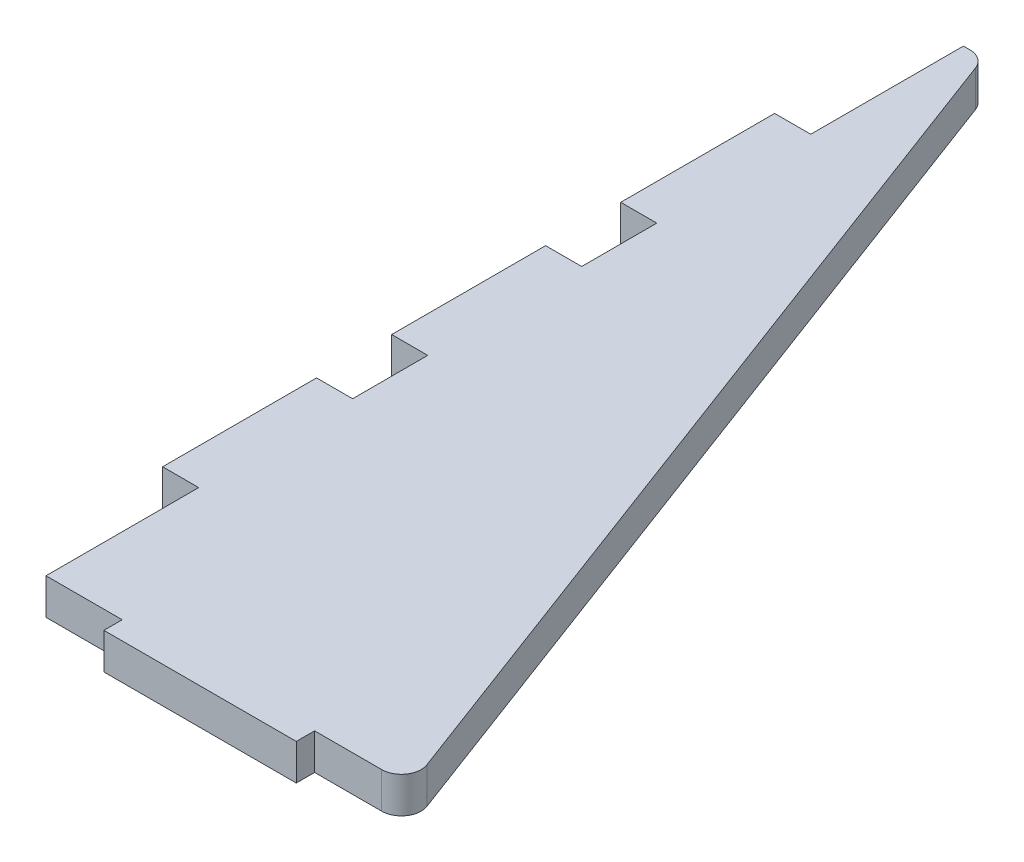
ISO-10303-21;
HEADER;
FILE_DESCRIPTION(('STEP AP214'),'2;1');
FILE_NAME('part.step','',(''),(''),'','','');
FILE_SCHEMA(('AUTOMOTIVE_DESIGN { 1 0 10303 214 1 1 1 1 }'));
ENDSEC;
DATA;
#1=APPLICATION_CONTEXT('core data for automotive mechanical design processes');
#2=APPLICATION_PROTOCOL_DEFINITION('international standard','automotive_design',2000,#1);
#3=PRODUCT_CONTEXT('',#1,'mechanical');
#4=PRODUCT('Part','Part','',(#3));
#5=PRODUCT_RELATED_PRODUCT_CATEGORY('part','',(#4));
#6=PRODUCT_DEFINITION_FORMATION('','',#4);
#7=PRODUCT_DEFINITION_CONTEXT('part definition',#1,'design');
#8=PRODUCT_DEFINITION('design','',#6,#7);
#9=PRODUCT_DEFINITION_SHAPE('','',#8);
#10=(LENGTH_UNIT() NAMED_UNIT(*) SI_UNIT(.MILLI.,.METRE.));
#11=(NAMED_UNIT(*) PLANE_ANGLE_UNIT() SI_UNIT($,.RADIAN.));
#12=(NAMED_UNIT(*) SI_UNIT($,.STERADIAN.) SOLID_ANGLE_UNIT());
#13=UNCERTAINTY_MEASURE_WITH_UNIT(LENGTH_MEASURE(1.E-05),#10,'distance_accuracy_value','');
#14=(GEOMETRIC_REPRESENTATION_CONTEXT(3) GLOBAL_UNCERTAINTY_ASSIGNED_CONTEXT((#13)) GLOBAL_UNIT_ASSIGNED_CONTEXT((#10,
#11,#12)) REPRESENTATION_CONTEXT('',''));
#15=CARTESIAN_POINT('',(0.,0.,0.));
#16=DIRECTION('',(0.,0.,1.));
#17=DIRECTION('',(1.,0.,0.));
#18=AXIS2_PLACEMENT_3D('',#15,#16,#17);
#19=CARTESIAN_POINT('',(41.402,-168.725008290558,76.3016));
#20=DIRECTION('',(0.,0.,1.));
#21=DIRECTION('',(1.,0.,0.));
#22=AXIS2_PLACEMENT_3D('',#19,#20,#21);
#23=PLANE('',#22);
#24=DIRECTION('',(0.,1.,0.));
#25=VECTOR('',#24,1.);
#26=CARTESIAN_POINT('',(41.402,-168.725008290558,76.3016));
#27=LINE('',#26,#25);
#28=CARTESIAN_POINT('',(41.402,0.,76.3016));
#29=VERTEX_POINT('',#28);
#30=CARTESIAN_POINT('',(41.402,6.,76.3016));
#31=VERTEX_POINT('',#30);
#32=EDGE_CURVE('E11',#29,#31,#27,.T.);
#33=ORIENTED_EDGE('',*,*,#32,.F.);
#34=DIRECTION('',(1.,0.,0.));
#35=VECTOR('',#34,1.);
#36=CARTESIAN_POINT('',(41.402,0.,76.3016));
#37=LINE('',#36,#35);
#38=CARTESIAN_POINT('',(52.5684735135771,0.,76.3016));
#39=VERTEX_POINT('',#38);
#40=EDGE_CURVE('E199',#29,#39,#37,.T.);
#41=ORIENTED_EDGE('',*,*,#40,.T.);
#42=DIRECTION('',(0.,1.,0.));
#43=VECTOR('',#42,1.);
#44=CARTESIAN_POINT('',(52.5684735135771,-168.725008290558,76.3016));
#45=LINE('',#44,#43);
#46=CARTESIAN_POINT('',(52.5684735135771,6.,76.3016));
#47=VERTEX_POINT('',#46);
#48=EDGE_CURVE('E195',#39,#47,#45,.T.);
#49=ORIENTED_EDGE('',*,*,#48,.T.);
#50=DIRECTION('',(1.,0.,0.));
#51=VECTOR('',#50,1.);
#52=CARTESIAN_POINT('',(41.402,6.,76.3016));
#53=LINE('',#52,#51);
#54=EDGE_CURVE('E197',#31,#47,#53,.T.);
#55=ORIENTED_EDGE('',*,*,#54,.F.);
#56=EDGE_LOOP('',(#33,#41,#49,#55));
#57=FACE_BOUND('',#56,.T.);
#58=ADVANCED_FACE('F39',(#57),#23,.T.);
#59=CARTESIAN_POINT('',(52.5684735135771,-168.725008290558,73.025));
#60=DIRECTION('',(0.,1.,0.));
#61=DIRECTION('',(0.,0.,1.));
#62=AXIS2_PLACEMENT_3D('',#59,#60,#61);
#63=CYLINDRICAL_SURFACE('',#62,3.27659999999999);
#64=ORIENTED_EDGE('',*,*,#48,.F.);
#65=CARTESIAN_POINT('',(52.5684735135771,0.,73.025));
#66=DIRECTION('',(0.,-1.,0.));
#67=DIRECTION('',(0.,0.,-1.));
#68=AXIS2_PLACEMENT_3D('',#65,#66,#67);
#69=CIRCLE('',#68,3.27659999999999);
#70=CARTESIAN_POINT('',(55.6364496967998,0.,71.8745089312915));
#71=VERTEX_POINT('',#70);
#72=EDGE_CURVE('E131',#39,#71,#69,.F.);
#73=ORIENTED_EDGE('',*,*,#72,.T.);
#74=DIRECTION('',(0.,1.,0.));
#75=VECTOR('',#74,1.);
#76=CARTESIAN_POINT('',(55.6364496967998,-168.725008290558,71.8745089312915));
#77=LINE('',#76,#75);
#78=CARTESIAN_POINT('',(55.6364496967998,6.,71.8745089312915));
#79=VERTEX_POINT('',#78);
#80=EDGE_CURVE('E190',#71,#79,#77,.T.);
#81=ORIENTED_EDGE('',*,*,#80,.T.);
#82=CARTESIAN_POINT('',(52.5684735135771,6.,73.025));
#83=DIRECTION('',(0.,1.,0.));
#84=DIRECTION('',(0.,0.,1.));
#85=AXIS2_PLACEMENT_3D('',#82,#83,#84);
#86=CIRCLE('',#85,3.27659999999999);
#87=EDGE_CURVE('E202',#47,#79,#86,.T.);
#88=ORIENTED_EDGE('',*,*,#87,.F.);
#89=EDGE_LOOP('',(#64,#73,#81,#88));
#90=FACE_BOUND('',#89,.T.);
#91=ADVANCED_FACE('F203',(#90),#63,.T.);
#92=CARTESIAN_POINT('',(55.6364496967998,-168.725008290558,71.8745089312915));
#93=DIRECTION('',(0.936329177569044,0.,-0.351123441588392));
#94=DIRECTION('',(-0.351123441588392,0.,-0.936329177569045));
#95=AXIS2_PLACEMENT_3D('',#92,#93,#94);
#96=PLANE('',#95);
#97=ORIENTED_EDGE('',*,*,#80,.F.);
#98=DIRECTION('',(-0.351123441588392,0.,-0.936329177569045));
#99=VECTOR('',#98,1.);
#100=CARTESIAN_POINT('',(55.6364496967998,0.,71.8745089312915));
#101=LINE('',#100,#99);
#102=CARTESIAN_POINT('',(0.867699696799826,0.,-74.1754910687086));
#103=VERTEX_POINT('',#102);
#104=EDGE_CURVE('E126',#71,#103,#101,.T.);
#105=ORIENTED_EDGE('',*,*,#104,.T.);
#106=DIRECTION('',(0.,1.,0.));
#107=VECTOR('',#106,1.);
#108=CARTESIAN_POINT('',(0.867699696799812,-168.725008290558,-74.1754910687086));
#109=LINE('',#108,#107);
#110=CARTESIAN_POINT('',(0.867699696799812,6.,-74.1754910687086));
#111=VERTEX_POINT('',#110);
#112=EDGE_CURVE('E313',#103,#111,#109,.T.);
#113=ORIENTED_EDGE('',*,*,#112,.T.);
#114=DIRECTION('',(-0.351123441588392,0.,-0.936329177569044));
#115=VECTOR('',#114,1.);
#116=CARTESIAN_POINT('',(55.6364496967998,6.,71.8745089312915));
#117=LINE('',#116,#115);
#118=EDGE_CURVE('E207',#79,#111,#117,.T.);
#119=ORIENTED_EDGE('',*,*,#118,.F.);
#120=EDGE_LOOP('',(#97,#105,#113,#119));
#121=FACE_BOUND('',#120,.T.);
#122=ADVANCED_FACE('F430',(#121),#96,.T.);
#123=CARTESIAN_POINT('',(-2.2002764864229,-168.725008290558,-73.025));
#124=DIRECTION('',(0.,1.,0.));
#125=DIRECTION('',(0.,0.,1.));
#126=AXIS2_PLACEMENT_3D('',#123,#124,#125);
#127=CYLINDRICAL_SURFACE('',#126,3.2766);
#128=ORIENTED_EDGE('',*,*,#112,.F.);
#129=CARTESIAN_POINT('',(-2.2002764864229,0.,-73.025));
#130=DIRECTION('',(0.,-1.,0.));
#131=DIRECTION('',(0.,0.,-1.));
#132=AXIS2_PLACEMENT_3D('',#129,#130,#131);
#133=CIRCLE('',#132,3.2766);
#134=CARTESIAN_POINT('',(-2.2002764864229,0.,-76.3016));
#135=VERTEX_POINT('',#134);
#136=EDGE_CURVE('E309',#103,#135,#133,.F.);
#137=ORIENTED_EDGE('',*,*,#136,.T.);
#138=DIRECTION('',(0.,1.,0.));
#139=VECTOR('',#138,1.);
#140=CARTESIAN_POINT('',(-2.2002764864229,-168.725008290558,-76.3016));
#141=LINE('',#140,#139);
#142=CARTESIAN_POINT('',(-2.2002764864229,6.,-76.3016));
#143=VERTEX_POINT('',#142);
#144=EDGE_CURVE('E308',#135,#143,#141,.T.);
#145=ORIENTED_EDGE('',*,*,#144,.T.);
#146=CARTESIAN_POINT('',(-2.2002764864229,6.,-73.025));
#147=DIRECTION('',(0.,1.,0.));
#148=DIRECTION('',(0.,0.,1.));
#149=AXIS2_PLACEMENT_3D('',#146,#147,#148);
#150=CIRCLE('',#149,3.2766);
#151=EDGE_CURVE('E423',#111,#143,#150,.T.);
#152=ORIENTED_EDGE('',*,*,#151,.F.);
#153=EDGE_LOOP('',(#128,#137,#145,#152));
#154=FACE_BOUND('',#153,.T.);
#155=ADVANCED_FACE('F433',(#154),#127,.T.);
#156=CARTESIAN_POINT('',(-2.2002764864229,-168.725008290558,-76.3016));
#157=DIRECTION('',(0.,0.,-1.));
#158=DIRECTION('',(-1.,0.,0.));
#159=AXIS2_PLACEMENT_3D('',#156,#157,#158);
#160=PLANE('',#159);
#161=ORIENTED_EDGE('',*,*,#144,.F.);
#162=DIRECTION('',(-1.,0.,0.));
#163=VECTOR('',#162,1.);
#164=CARTESIAN_POINT('',(-2.2002764864229,0.,-76.3016));
#165=LINE('',#164,#163);
#166=CARTESIAN_POINT('',(-3.2766,0.,-76.3016));
#167=VERTEX_POINT('',#166);
#168=EDGE_CURVE('E304',#135,#167,#165,.T.);
#169=ORIENTED_EDGE('',*,*,#168,.T.);
#170=DIRECTION('',(0.,1.,0.));
#171=VECTOR('',#170,1.);
#172=CARTESIAN_POINT('',(-3.2766,-168.725008290558,-76.3016));
#173=LINE('',#172,#171);
#174=CARTESIAN_POINT('',(-3.2766,6.,-76.3016));
#175=VERTEX_POINT('',#174);
#176=EDGE_CURVE('E303',#167,#175,#173,.T.);
#177=ORIENTED_EDGE('',*,*,#176,.T.);
#178=DIRECTION('',(-1.,0.,0.));
#179=VECTOR('',#178,1.);
#180=CARTESIAN_POINT('',(-2.2002764864229,6.,-76.3016));
#181=LINE('',#180,#179);
#182=EDGE_CURVE('E419',#143,#175,#181,.T.);
#183=ORIENTED_EDGE('',*,*,#182,.F.);
#184=EDGE_LOOP('',(#161,#169,#177,#183));
#185=FACE_BOUND('',#184,.T.);
#186=ADVANCED_FACE('F437',(#185),#160,.T.);
#187=CARTESIAN_POINT('',(-3.2766,-168.725008290558,-76.3016));
#188=DIRECTION('',(-1.,0.,0.));
#189=DIRECTION('',(0.,0.,1.));
#190=AXIS2_PLACEMENT_3D('',#187,#188,#189);
#191=PLANE('',#190);
#192=ORIENTED_EDGE('',*,*,#176,.F.);
#193=DIRECTION('',(0.,0.,1.));
#194=VECTOR('',#193,1.);
#195=CARTESIAN_POINT('',(-3.2766,0.,-76.3016));
#196=LINE('',#195,#194);
#197=CARTESIAN_POINT('',(-3.2766,0.,-50.9016));
#198=VERTEX_POINT('',#197);
#199=EDGE_CURVE('E299',#167,#198,#196,.T.);
#200=ORIENTED_EDGE('',*,*,#199,.T.);
#201=DIRECTION('',(0.,1.,0.));
#202=VECTOR('',#201,1.);
#203=CARTESIAN_POINT('',(-3.2766,-168.725008290558,-50.9016));
#204=LINE('',#203,#202);
#205=CARTESIAN_POINT('',(-3.2766,6.,-50.9016));
#206=VERTEX_POINT('',#205);
#207=EDGE_CURVE('E298',#198,#206,#204,.T.);
#208=ORIENTED_EDGE('',*,*,#207,.T.);
#209=DIRECTION('',(0.,0.,1.));
#210=VECTOR('',#209,1.);
#211=CARTESIAN_POINT('',(-3.2766,6.,-76.3016));
#212=LINE('',#211,#210);
#213=EDGE_CURVE('E415',#175,#206,#212,.T.);
#214=ORIENTED_EDGE('',*,*,#213,.F.);
#215=EDGE_LOOP('',(#192,#200,#208,#214));
#216=FACE_BOUND('',#215,.T.);
#217=ADVANCED_FACE('F442',(#216),#191,.T.);
#218=CARTESIAN_POINT('',(-3.2766,-168.725008290558,-50.9016));
#219=DIRECTION('',(0.,0.,-1.));
#220=DIRECTION('',(-1.,0.,0.));
#221=AXIS2_PLACEMENT_3D('',#218,#219,#220);
#222=PLANE('',#221);
#223=ORIENTED_EDGE('',*,*,#207,.F.);
#224=DIRECTION('',(-1.,0.,0.));
#225=VECTOR('',#224,1.);
#226=CARTESIAN_POINT('',(-3.2766,0.,-50.9016));
#227=LINE('',#226,#225);
#228=CARTESIAN_POINT('',(-9.2766,0.,-50.9016));
#229=VERTEX_POINT('',#228);
#230=EDGE_CURVE('E294',#198,#229,#227,.T.);
#231=ORIENTED_EDGE('',*,*,#230,.T.);
#232=DIRECTION('',(0.,1.,0.));
#233=VECTOR('',#232,1.);
#234=CARTESIAN_POINT('',(-9.2766,-168.725008290558,-50.9016));
#235=LINE('',#234,#233);
#236=CARTESIAN_POINT('',(-9.2766,6.,-50.9016));
#237=VERTEX_POINT('',#236);
#238=EDGE_CURVE('E293',#229,#237,#235,.T.);
#239=ORIENTED_EDGE('',*,*,#238,.T.);
#240=DIRECTION('',(-1.,0.,0.));
#241=VECTOR('',#240,1.);
#242=CARTESIAN_POINT('',(-3.2766,6.,-50.9016));
#243=LINE('',#242,#241);
#244=EDGE_CURVE('E411',#206,#237,#243,.T.);
#245=ORIENTED_EDGE('',*,*,#244,.F.);
#246=EDGE_LOOP('',(#223,#231,#239,#245));
#247=FACE_BOUND('',#246,.T.);
#248=ADVANCED_FACE('F445',(#247),#222,.T.);
#249=CARTESIAN_POINT('',(-9.2766,-168.725008290558,-50.9016));
#250=DIRECTION('',(-1.,0.,0.));
#251=DIRECTION('',(0.,0.,1.));
#252=AXIS2_PLACEMENT_3D('',#249,#250,#251);
#253=PLANE('',#252);
#254=ORIENTED_EDGE('',*,*,#238,.F.);
#255=DIRECTION('',(0.,0.,1.));
#256=VECTOR('',#255,1.);
#257=CARTESIAN_POINT('',(-9.2766,0.,-50.9016));
#258=LINE('',#257,#256);
#259=CARTESIAN_POINT('',(-9.2766,0.,-25.2984));
#260=VERTEX_POINT('',#259);
#261=EDGE_CURVE('E289',#229,#260,#258,.T.);
#262=ORIENTED_EDGE('',*,*,#261,.T.);
#263=DIRECTION('',(0.,1.,0.));
#264=VECTOR('',#263,1.);
#265=CARTESIAN_POINT('',(-9.2766,-168.725008290558,-25.2984));
#266=LINE('',#265,#264);
#267=CARTESIAN_POINT('',(-9.2766,6.,-25.2984));
#268=VERTEX_POINT('',#267);
#269=EDGE_CURVE('E288',#260,#268,#266,.T.);
#270=ORIENTED_EDGE('',*,*,#269,.T.);
#271=DIRECTION('',(0.,0.,1.));
#272=VECTOR('',#271,1.);
#273=CARTESIAN_POINT('',(-9.2766,6.,-50.9016));
#274=LINE('',#273,#272);
#275=EDGE_CURVE('E407',#237,#268,#274,.T.);
#276=ORIENTED_EDGE('',*,*,#275,.F.);
#277=EDGE_LOOP('',(#254,#262,#270,#276));
#278=FACE_BOUND('',#277,.T.);
#279=ADVANCED_FACE('F449',(#278),#253,.T.);
#280=CARTESIAN_POINT('',(-9.2766,-168.725008290558,-25.2984));
#281=DIRECTION('',(0.,0.,1.));
#282=DIRECTION('',(1.,0.,0.));
#283=AXIS2_PLACEMENT_3D('',#280,#281,#282);
#284=PLANE('',#283);
#285=ORIENTED_EDGE('',*,*,#269,.F.);
#286=DIRECTION('',(1.,0.,0.));
#287=VECTOR('',#286,1.);
#288=CARTESIAN_POINT('',(-9.2766,0.,-25.2984));
#289=LINE('',#288,#287);
#290=CARTESIAN_POINT('',(-3.2766,0.,-25.2984));
#291=VERTEX_POINT('',#290);
#292=EDGE_CURVE('E284',#260,#291,#289,.T.);
#293=ORIENTED_EDGE('',*,*,#292,.T.);
#294=DIRECTION('',(0.,1.,0.));
#295=VECTOR('',#294,1.);
#296=CARTESIAN_POINT('',(-3.2766,-168.725008290558,-25.2984));
#297=LINE('',#296,#295);
#298=CARTESIAN_POINT('',(-3.2766,6.,-25.2984));
#299=VERTEX_POINT('',#298);
#300=EDGE_CURVE('E283',#291,#299,#297,.T.);
#301=ORIENTED_EDGE('',*,*,#300,.T.);
#302=DIRECTION('',(1.,0.,0.));
#303=VECTOR('',#302,1.);
#304=CARTESIAN_POINT('',(-9.2766,6.,-25.2984));
#305=LINE('',#304,#303);
#306=EDGE_CURVE('E403',#268,#299,#305,.T.);
#307=ORIENTED_EDGE('',*,*,#306,.F.);
#308=EDGE_LOOP('',(#285,#293,#301,#307));
#309=FACE_BOUND('',#308,.T.);
#310=ADVANCED_FACE('F454',(#309),#284,.T.);
#311=CARTESIAN_POINT('',(-3.2766,-168.725008290558,-25.2984));
#312=DIRECTION('',(-1.,0.,0.));
#313=DIRECTION('',(0.,0.,1.));
#314=AXIS2_PLACEMENT_3D('',#311,#312,#313);
#315=PLANE('',#314);
#316=ORIENTED_EDGE('',*,*,#300,.F.);
#317=DIRECTION('',(0.,0.,1.));
#318=VECTOR('',#317,1.);
#319=CARTESIAN_POINT('',(-3.2766,0.,-25.2984));
#320=LINE('',#319,#318);
#321=CARTESIAN_POINT('',(-3.2766,0.,-12.8016));
#322=VERTEX_POINT('',#321);
#323=EDGE_CURVE('E279',#291,#322,#320,.T.);
#324=ORIENTED_EDGE('',*,*,#323,.T.);
#325=DIRECTION('',(0.,1.,0.));
#326=VECTOR('',#325,1.);
#327=CARTESIAN_POINT('',(-3.2766,-168.725008290558,-12.8016));
#328=LINE('',#327,#326);
#329=CARTESIAN_POINT('',(-3.2766,6.,-12.8016));
#330=VERTEX_POINT('',#329);
#331=EDGE_CURVE('E278',#322,#330,#328,.T.);
#332=ORIENTED_EDGE('',*,*,#331,.T.);
#333=DIRECTION('',(0.,0.,1.));
#334=VECTOR('',#333,1.);
#335=CARTESIAN_POINT('',(-3.2766,6.,-25.2984));
#336=LINE('',#335,#334);
#337=EDGE_CURVE('E399',#299,#330,#336,.T.);
#338=ORIENTED_EDGE('',*,*,#337,.F.);
#339=EDGE_LOOP('',(#316,#324,#332,#338));
#340=FACE_BOUND('',#339,.T.);
#341=ADVANCED_FACE('F457',(#340),#315,.T.);
#342=CARTESIAN_POINT('',(-3.2766,-168.725008290558,-12.8016));
#343=DIRECTION('',(0.,0.,-1.));
#344=DIRECTION('',(-1.,0.,0.));
#345=AXIS2_PLACEMENT_3D('',#342,#343,#344);
#346=PLANE('',#345);
#347=ORIENTED_EDGE('',*,*,#331,.F.);
#348=DIRECTION('',(-1.,0.,0.));
#349=VECTOR('',#348,1.);
#350=CARTESIAN_POINT('',(-3.2766,0.,-12.8016));
#351=LINE('',#350,#349);
#352=CARTESIAN_POINT('',(-9.2766,0.,-12.8016));
#353=VERTEX_POINT('',#352);
#354=EDGE_CURVE('E274',#322,#353,#351,.T.);
#355=ORIENTED_EDGE('',*,*,#354,.T.);
#356=DIRECTION('',(0.,1.,0.));
#357=VECTOR('',#356,1.);
#358=CARTESIAN_POINT('',(-9.2766,-168.725008290558,-12.8016));
#359=LINE('',#358,#357);
#360=CARTESIAN_POINT('',(-9.2766,6.,-12.8016));
#361=VERTEX_POINT('',#360);
#362=EDGE_CURVE('E273',#353,#361,#359,.T.);
#363=ORIENTED_EDGE('',*,*,#362,.T.);
#364=DIRECTION('',(-1.,0.,0.));
#365=VECTOR('',#364,1.);
#366=CARTESIAN_POINT('',(-3.2766,6.,-12.8016));
#367=LINE('',#366,#365);
#368=EDGE_CURVE('E395',#330,#361,#367,.T.);
#369=ORIENTED_EDGE('',*,*,#368,.F.);
#370=EDGE_LOOP('',(#347,#355,#363,#369));
#371=FACE_BOUND('',#370,.T.);
#372=ADVANCED_FACE('F461',(#371),#346,.T.);
#373=CARTESIAN_POINT('',(-9.2766,-168.725008290558,-12.8016));
#374=DIRECTION('',(-1.,0.,0.));
#375=DIRECTION('',(0.,0.,1.));
#376=AXIS2_PLACEMENT_3D('',#373,#374,#375);
#377=PLANE('',#376);
#378=ORIENTED_EDGE('',*,*,#362,.F.);
#379=DIRECTION('',(0.,0.,1.));
#380=VECTOR('',#379,1.);
#381=CARTESIAN_POINT('',(-9.2766,0.,-12.8016));
#382=LINE('',#381,#380);
#383=CARTESIAN_POINT('',(-9.2766,0.,12.8016));
#384=VERTEX_POINT('',#383);
#385=EDGE_CURVE('E269',#353,#384,#382,.T.);
#386=ORIENTED_EDGE('',*,*,#385,.T.);
#387=DIRECTION('',(0.,1.,0.));
#388=VECTOR('',#387,1.);
#389=CARTESIAN_POINT('',(-9.2766,-168.725008290558,12.8016));
#390=LINE('',#389,#388);
#391=CARTESIAN_POINT('',(-9.2766,6.,12.8016));
#392=VERTEX_POINT('',#391);
#393=EDGE_CURVE('E268',#384,#392,#390,.T.);
#394=ORIENTED_EDGE('',*,*,#393,.T.);
#395=DIRECTION('',(0.,0.,1.));
#396=VECTOR('',#395,1.);
#397=CARTESIAN_POINT('',(-9.2766,6.,-12.8016));
#398=LINE('',#397,#396);
#399=EDGE_CURVE('E391',#361,#392,#398,.T.);
#400=ORIENTED_EDGE('',*,*,#399,.F.);
#401=EDGE_LOOP('',(#378,#386,#394,#400));
#402=FACE_BOUND('',#401,.T.);
#403=ADVANCED_FACE('F466',(#402),#377,.T.);
#404=CARTESIAN_POINT('',(-9.2766,-168.725008290558,12.8016));
#405=DIRECTION('',(0.,0.,1.));
#406=DIRECTION('',(1.,0.,0.));
#407=AXIS2_PLACEMENT_3D('',#404,#405,#406);
#408=PLANE('',#407);
#409=ORIENTED_EDGE('',*,*,#393,.F.);
#410=DIRECTION('',(1.,0.,0.));
#411=VECTOR('',#410,1.);
#412=CARTESIAN_POINT('',(-9.2766,0.,12.8016));
#413=LINE('',#412,#411);
#414=CARTESIAN_POINT('',(-3.2766,0.,12.8016));
#415=VERTEX_POINT('',#414);
#416=EDGE_CURVE('E264',#384,#415,#413,.T.);
#417=ORIENTED_EDGE('',*,*,#416,.T.);
#418=DIRECTION('',(0.,1.,0.));
#419=VECTOR('',#418,1.);
#420=CARTESIAN_POINT('',(-3.2766,-168.725008290558,12.8016));
#421=LINE('',#420,#419);
#422=CARTESIAN_POINT('',(-3.2766,6.,12.8016));
#423=VERTEX_POINT('',#422);
#424=EDGE_CURVE('E263',#415,#423,#421,.T.);
#425=ORIENTED_EDGE('',*,*,#424,.T.);
#426=DIRECTION('',(1.,0.,0.));
#427=VECTOR('',#426,1.);
#428=CARTESIAN_POINT('',(-9.2766,6.,12.8016));
#429=LINE('',#428,#427);
#430=EDGE_CURVE('E387',#392,#423,#429,.T.);
#431=ORIENTED_EDGE('',*,*,#430,.F.);
#432=EDGE_LOOP('',(#409,#417,#425,#431));
#433=FACE_BOUND('',#432,.T.);
#434=ADVANCED_FACE('F469',(#433),#408,.T.);
#435=CARTESIAN_POINT('',(-3.2766,-168.725008290558,12.8016));
#436=DIRECTION('',(-1.,0.,0.));
#437=DIRECTION('',(0.,0.,1.));
#438=AXIS2_PLACEMENT_3D('',#435,#436,#437);
#439=PLANE('',#438);
#440=ORIENTED_EDGE('',*,*,#424,.F.);
#441=DIRECTION('',(0.,0.,1.));
#442=VECTOR('',#441,1.);
#443=CARTESIAN_POINT('',(-3.2766,0.,12.8016));
#444=LINE('',#443,#442);
#445=CARTESIAN_POINT('',(-3.27660000000001,0.,25.2984));
#446=VERTEX_POINT('',#445);
#447=EDGE_CURVE('E259',#415,#446,#444,.T.);
#448=ORIENTED_EDGE('',*,*,#447,.T.);
#449=DIRECTION('',(0.,1.,0.));
#450=VECTOR('',#449,1.);
#451=CARTESIAN_POINT('',(-3.27660000000001,-168.725008290558,25.2984));
#452=LINE('',#451,#450);
#453=CARTESIAN_POINT('',(-3.27660000000001,6.,25.2984));
#454=VERTEX_POINT('',#453);
#455=EDGE_CURVE('E258',#446,#454,#452,.T.);
#456=ORIENTED_EDGE('',*,*,#455,.T.);
#457=DIRECTION('',(0.,0.,1.));
#458=VECTOR('',#457,1.);
#459=CARTESIAN_POINT('',(-3.2766,6.,12.8016));
#460=LINE('',#459,#458);
#461=EDGE_CURVE('E383',#423,#454,#460,.T.);
#462=ORIENTED_EDGE('',*,*,#461,.F.);
#463=EDGE_LOOP('',(#440,#448,#456,#462));
#464=FACE_BOUND('',#463,.T.);
#465=ADVANCED_FACE('F473',(#464),#439,.T.);
#466=CARTESIAN_POINT('',(-3.27660000000001,-168.725008290558,25.2984));
#467=DIRECTION('',(0.,0.,-1.));
#468=DIRECTION('',(-1.,0.,0.));
#469=AXIS2_PLACEMENT_3D('',#466,#467,#468);
#470=PLANE('',#469);
#471=ORIENTED_EDGE('',*,*,#455,.F.);
#472=DIRECTION('',(-1.,0.,0.));
#473=VECTOR('',#472,1.);
#474=CARTESIAN_POINT('',(-3.27660000000001,0.,25.2984));
#475=LINE('',#474,#473);
#476=CARTESIAN_POINT('',(-9.2766,0.,25.2984));
#477=VERTEX_POINT('',#476);
#478=EDGE_CURVE('E254',#446,#477,#475,.T.);
#479=ORIENTED_EDGE('',*,*,#478,.T.);
#480=DIRECTION('',(0.,1.,0.));
#481=VECTOR('',#480,1.);
#482=CARTESIAN_POINT('',(-9.2766,-168.725008290558,25.2984));
#483=LINE('',#482,#481);
#484=CARTESIAN_POINT('',(-9.2766,6.,25.2984));
#485=VERTEX_POINT('',#484);
#486=EDGE_CURVE('E253',#477,#485,#483,.T.);
#487=ORIENTED_EDGE('',*,*,#486,.T.);
#488=DIRECTION('',(-1.,0.,0.));
#489=VECTOR('',#488,1.);
#490=CARTESIAN_POINT('',(-3.27660000000001,6.,25.2984));
#491=LINE('',#490,#489);
#492=EDGE_CURVE('E379',#454,#485,#491,.T.);
#493=ORIENTED_EDGE('',*,*,#492,.F.);
#494=EDGE_LOOP('',(#471,#479,#487,#493));
#495=FACE_BOUND('',#494,.T.);
#496=ADVANCED_FACE('F478',(#495),#470,.T.);
#497=CARTESIAN_POINT('',(-9.2766,-168.725008290558,25.2984));
#498=DIRECTION('',(-1.,0.,0.));
#499=DIRECTION('',(0.,0.,1.));
#500=AXIS2_PLACEMENT_3D('',#497,#498,#499);
#501=PLANE('',#500);
#502=ORIENTED_EDGE('',*,*,#486,.F.);
#503=DIRECTION('',(0.,0.,1.));
#504=VECTOR('',#503,1.);
#505=CARTESIAN_POINT('',(-9.2766,0.,25.2984));
#506=LINE('',#505,#504);
#507=CARTESIAN_POINT('',(-9.2766,0.,50.9016));
#508=VERTEX_POINT('',#507);
#509=EDGE_CURVE('E249',#477,#508,#506,.T.);
#510=ORIENTED_EDGE('',*,*,#509,.T.);
#511=DIRECTION('',(0.,1.,0.));
#512=VECTOR('',#511,1.);
#513=CARTESIAN_POINT('',(-9.2766,-168.725008290558,50.9016));
#514=LINE('',#513,#512);
#515=CARTESIAN_POINT('',(-9.2766,6.,50.9016));
#516=VERTEX_POINT('',#515);
#517=EDGE_CURVE('E248',#508,#516,#514,.T.);
#518=ORIENTED_EDGE('',*,*,#517,.T.);
#519=DIRECTION('',(0.,0.,1.));
#520=VECTOR('',#519,1.);
#521=CARTESIAN_POINT('',(-9.2766,6.,25.2984));
#522=LINE('',#521,#520);
#523=EDGE_CURVE('E375',#485,#516,#522,.T.);
#524=ORIENTED_EDGE('',*,*,#523,.F.);
#525=EDGE_LOOP('',(#502,#510,#518,#524));
#526=FACE_BOUND('',#525,.T.);
#527=ADVANCED_FACE('F481',(#526),#501,.T.);
#528=CARTESIAN_POINT('',(-9.2766,-168.725008290558,50.9016));
#529=DIRECTION('',(0.,0.,1.));
#530=DIRECTION('',(1.,0.,0.));
#531=AXIS2_PLACEMENT_3D('',#528,#529,#530);
#532=PLANE('',#531);
#533=ORIENTED_EDGE('',*,*,#517,.F.);
#534=DIRECTION('',(1.,0.,0.));
#535=VECTOR('',#534,1.);
#536=CARTESIAN_POINT('',(-9.2766,0.,50.9016));
#537=LINE('',#536,#535);
#538=CARTESIAN_POINT('',(-3.27660000000001,0.,50.9015999999999));
#539=VERTEX_POINT('',#538);
#540=EDGE_CURVE('E244',#508,#539,#537,.T.);
#541=ORIENTED_EDGE('',*,*,#540,.T.);
#542=DIRECTION('',(0.,1.,0.));
#543=VECTOR('',#542,1.);
#544=CARTESIAN_POINT('',(-3.27660000000001,-168.725008290558,50.9015999999999));
#545=LINE('',#544,#543);
#546=CARTESIAN_POINT('',(-3.27660000000001,6.,50.9015999999999));
#547=VERTEX_POINT('',#546);
#548=EDGE_CURVE('E243',#539,#547,#545,.T.);
#549=ORIENTED_EDGE('',*,*,#548,.T.);
#550=DIRECTION('',(1.,0.,0.));
#551=VECTOR('',#550,1.);
#552=CARTESIAN_POINT('',(-9.2766,6.,50.9016));
#553=LINE('',#552,#551);
#554=EDGE_CURVE('E371',#516,#547,#553,.T.);
#555=ORIENTED_EDGE('',*,*,#554,.F.);
#556=EDGE_LOOP('',(#533,#541,#549,#555));
#557=FACE_BOUND('',#556,.T.);
#558=ADVANCED_FACE('F485',(#557),#532,.T.);
#559=CARTESIAN_POINT('',(-3.27660000000001,-168.725008290558,50.9015999999999));
#560=DIRECTION('',(-1.,0.,0.));
#561=DIRECTION('',(0.,0.,1.));
#562=AXIS2_PLACEMENT_3D('',#559,#560,#561);
#563=PLANE('',#562);
#564=ORIENTED_EDGE('',*,*,#548,.F.);
#565=DIRECTION('',(0.,0.,1.));
#566=VECTOR('',#565,1.);
#567=CARTESIAN_POINT('',(-3.27660000000001,0.,50.9015999999999));
#568=LINE('',#567,#566);
#569=CARTESIAN_POINT('',(-3.27660000000002,0.,76.3016));
#570=VERTEX_POINT('',#569);
#571=EDGE_CURVE('E239',#539,#570,#568,.T.);
#572=ORIENTED_EDGE('',*,*,#571,.T.);
#573=DIRECTION('',(0.,1.,0.));
#574=VECTOR('',#573,1.);
#575=CARTESIAN_POINT('',(-3.27660000000002,-168.725008290558,76.3016));
#576=LINE('',#575,#574);
#577=CARTESIAN_POINT('',(-3.27660000000002,6.,76.3016));
#578=VERTEX_POINT('',#577);
#579=EDGE_CURVE('E238',#570,#578,#576,.T.);
#580=ORIENTED_EDGE('',*,*,#579,.T.);
#581=DIRECTION('',(0.,0.,1.));
#582=VECTOR('',#581,1.);
#583=CARTESIAN_POINT('',(-3.27660000000001,6.,50.9015999999999));
#584=LINE('',#583,#582);
#585=EDGE_CURVE('E367',#547,#578,#584,.T.);
#586=ORIENTED_EDGE('',*,*,#585,.F.);
#587=EDGE_LOOP('',(#564,#572,#580,#586));
#588=FACE_BOUND('',#587,.T.);
#589=ADVANCED_FACE('F490',(#588),#563,.T.);
#590=CARTESIAN_POINT('',(-3.27660000000002,-168.725008290558,76.3016));
#591=DIRECTION('',(0.,0.,1.));
#592=DIRECTION('',(1.,0.,0.));
#593=AXIS2_PLACEMENT_3D('',#590,#591,#592);
#594=PLANE('',#593);
#595=ORIENTED_EDGE('',*,*,#579,.F.);
#596=DIRECTION('',(1.,0.,0.));
#597=VECTOR('',#596,1.);
#598=CARTESIAN_POINT('',(-3.27660000000002,0.,76.3016));
#599=LINE('',#598,#597);
#600=CARTESIAN_POINT('',(9.39800000000002,0.,76.3016));
#601=VERTEX_POINT('',#600);
#602=EDGE_CURVE('E234',#570,#601,#599,.T.);
#603=ORIENTED_EDGE('',*,*,#602,.T.);
#604=DIRECTION('',(0.,1.,0.));
#605=VECTOR('',#604,1.);
#606=CARTESIAN_POINT('',(9.39800000000002,-168.725008290558,76.3016));
#607=LINE('',#606,#605);
#608=CARTESIAN_POINT('',(9.39800000000002,6.,76.3016));
#609=VERTEX_POINT('',#608);
#610=EDGE_CURVE('E233',#601,#609,#607,.T.);
#611=ORIENTED_EDGE('',*,*,#610,.T.);
#612=DIRECTION('',(1.,0.,0.));
#613=VECTOR('',#612,1.);
#614=CARTESIAN_POINT('',(-3.27660000000002,6.,76.3016));
#615=LINE('',#614,#613);
#616=EDGE_CURVE('E363',#578,#609,#615,.T.);
#617=ORIENTED_EDGE('',*,*,#616,.F.);
#618=EDGE_LOOP('',(#595,#603,#611,#617));
#619=FACE_BOUND('',#618,.T.);
#620=ADVANCED_FACE('F493',(#619),#594,.T.);
#621=CARTESIAN_POINT('',(9.39800000000002,-168.725008290558,76.3016));
#622=DIRECTION('',(-1.,0.,0.));
#623=DIRECTION('',(0.,0.,1.));
#624=AXIS2_PLACEMENT_3D('',#621,#622,#623);
#625=PLANE('',#624);
#626=ORIENTED_EDGE('',*,*,#610,.F.);
#627=DIRECTION('',(0.,0.,1.));
#628=VECTOR('',#627,1.);
#629=CARTESIAN_POINT('',(9.39800000000002,0.,76.3016));
#630=LINE('',#629,#628);
#631=CARTESIAN_POINT('',(9.39800000000001,0.,79.3496));
#632=VERTEX_POINT('',#631);
#633=EDGE_CURVE('E229',#601,#632,#630,.T.);
#634=ORIENTED_EDGE('',*,*,#633,.T.);
#635=DIRECTION('',(0.,1.,0.));
#636=VECTOR('',#635,1.);
#637=CARTESIAN_POINT('',(9.39800000000001,-168.725008290558,79.3496));
#638=LINE('',#637,#636);
#639=CARTESIAN_POINT('',(9.39800000000001,6.,79.3496));
#640=VERTEX_POINT('',#639);
#641=EDGE_CURVE('E228',#632,#640,#638,.T.);
#642=ORIENTED_EDGE('',*,*,#641,.T.);
#643=DIRECTION('',(0.,0.,1.));
#644=VECTOR('',#643,1.);
#645=CARTESIAN_POINT('',(9.39800000000002,6.,76.3016));
#646=LINE('',#645,#644);
#647=EDGE_CURVE('E359',#609,#640,#646,.T.);
#648=ORIENTED_EDGE('',*,*,#647,.F.);
#649=EDGE_LOOP('',(#626,#634,#642,#648));
#650=FACE_BOUND('',#649,.T.);
#651=ADVANCED_FACE('F497',(#650),#625,.T.);
#652=CARTESIAN_POINT('',(9.39800000000001,-168.725008290558,79.3496));
#653=DIRECTION('',(0.,0.,1.));
#654=DIRECTION('',(1.,0.,0.));
#655=AXIS2_PLACEMENT_3D('',#652,#653,#654);
#656=PLANE('',#655);
#657=ORIENTED_EDGE('',*,*,#641,.F.);
#658=DIRECTION('',(1.,0.,0.));
#659=VECTOR('',#658,1.);
#660=CARTESIAN_POINT('',(9.39800000000001,0.,79.3496));
#661=LINE('',#660,#659);
#662=CARTESIAN_POINT('',(41.402,0.,79.3496));
#663=VERTEX_POINT('',#662);
#664=EDGE_CURVE('E224',#632,#663,#661,.T.);
#665=ORIENTED_EDGE('',*,*,#664,.T.);
#666=DIRECTION('',(0.,1.,0.));
#667=VECTOR('',#666,1.);
#668=CARTESIAN_POINT('',(41.402,-168.725008290558,79.3496));
#669=LINE('',#668,#667);
#670=CARTESIAN_POINT('',(41.402,6.,79.3496));
#671=VERTEX_POINT('',#670);
#672=EDGE_CURVE('E223',#663,#671,#669,.T.);
#673=ORIENTED_EDGE('',*,*,#672,.T.);
#674=DIRECTION('',(1.,0.,0.));
#675=VECTOR('',#674,1.);
#676=CARTESIAN_POINT('',(9.39800000000001,6.,79.3496));
#677=LINE('',#676,#675);
#678=EDGE_CURVE('E220',#640,#671,#677,.T.);
#679=ORIENTED_EDGE('',*,*,#678,.F.);
#680=EDGE_LOOP('',(#657,#665,#673,#679));
#681=FACE_BOUND('',#680,.T.);
#682=ADVANCED_FACE('F501',(#681),#656,.T.);
#683=CARTESIAN_POINT('',(41.402,-168.725008290558,79.3496));
#684=DIRECTION('',(1.,0.,0.));
#685=DIRECTION('',(0.,0.,-1.));
#686=AXIS2_PLACEMENT_3D('',#683,#684,#685);
#687=PLANE('',#686);
#688=ORIENTED_EDGE('',*,*,#672,.F.);
#689=DIRECTION('',(0.,0.,-1.));
#690=VECTOR('',#689,1.);
#691=CARTESIAN_POINT('',(41.402,0.,79.3496));
#692=LINE('',#691,#690);
#693=EDGE_CURVE('E49',#663,#29,#692,.T.);
#694=ORIENTED_EDGE('',*,*,#693,.T.);
#695=ORIENTED_EDGE('',*,*,#32,.T.);
#696=DIRECTION('',(0.,0.,-1.));
#697=VECTOR('',#696,1.);
#698=CARTESIAN_POINT('',(41.402,6.,79.3496));
#699=LINE('',#698,#697);
#700=EDGE_CURVE('E211',#671,#31,#699,.T.);
#701=ORIENTED_EDGE('',*,*,#700,.F.);
#702=EDGE_LOOP('',(#688,#694,#695,#701));
#703=FACE_BOUND('',#702,.T.);
#704=ADVANCED_FACE('F503',(#703),#687,.T.);
#705=CARTESIAN_POINT('',(0.,6.,0.));
#706=DIRECTION('',(0.,-1.,0.));
#707=DIRECTION('',(0.,0.,-1.));
#708=AXIS2_PLACEMENT_3D('',#705,#706,#707);
#709=PLANE('',#708);
#710=ORIENTED_EDGE('',*,*,#700,.T.);
#711=ORIENTED_EDGE('',*,*,#54,.T.);
#712=ORIENTED_EDGE('',*,*,#87,.T.);
#713=ORIENTED_EDGE('',*,*,#118,.T.);
#714=ORIENTED_EDGE('',*,*,#151,.T.);
#715=ORIENTED_EDGE('',*,*,#182,.T.);
#716=ORIENTED_EDGE('',*,*,#213,.T.);
#717=ORIENTED_EDGE('',*,*,#244,.T.);
#718=ORIENTED_EDGE('',*,*,#275,.T.);
#719=ORIENTED_EDGE('',*,*,#306,.T.);
#720=ORIENTED_EDGE('',*,*,#337,.T.);
#721=ORIENTED_EDGE('',*,*,#368,.T.);
#722=ORIENTED_EDGE('',*,*,#399,.T.);
#723=ORIENTED_EDGE('',*,*,#430,.T.);
#724=ORIENTED_EDGE('',*,*,#461,.T.);
#725=ORIENTED_EDGE('',*,*,#492,.T.);
#726=ORIENTED_EDGE('',*,*,#523,.T.);
#727=ORIENTED_EDGE('',*,*,#554,.T.);
#728=ORIENTED_EDGE('',*,*,#585,.T.);
#729=ORIENTED_EDGE('',*,*,#616,.T.);
#730=ORIENTED_EDGE('',*,*,#647,.T.);
#731=ORIENTED_EDGE('',*,*,#678,.T.);
#732=EDGE_LOOP('',(#710,#711,#712,#713,#714,#715,#716,#717,#718,#719,#720,#721,#722,#723,#724,
#725,#726,#727,#728,#729,#730,#731));
#733=FACE_BOUND('',#732,.T.);
#734=ADVANCED_FACE('F209',(#733),#709,.F.);
#735=CARTESIAN_POINT('',(0.,0.,0.));
#736=DIRECTION('',(0.,-1.,0.));
#737=DIRECTION('',(0.,0.,-1.));
#738=AXIS2_PLACEMENT_3D('',#735,#736,#737);
#739=PLANE('',#738);
#740=ORIENTED_EDGE('',*,*,#693,.F.);
#741=ORIENTED_EDGE('',*,*,#664,.F.);
#742=ORIENTED_EDGE('',*,*,#633,.F.);
#743=ORIENTED_EDGE('',*,*,#602,.F.);
#744=ORIENTED_EDGE('',*,*,#571,.F.);
#745=ORIENTED_EDGE('',*,*,#540,.F.);
#746=ORIENTED_EDGE('',*,*,#509,.F.);
#747=ORIENTED_EDGE('',*,*,#478,.F.);
#748=ORIENTED_EDGE('',*,*,#447,.F.);
#749=ORIENTED_EDGE('',*,*,#416,.F.);
#750=ORIENTED_EDGE('',*,*,#385,.F.);
#751=ORIENTED_EDGE('',*,*,#354,.F.);
#752=ORIENTED_EDGE('',*,*,#323,.F.);
#753=ORIENTED_EDGE('',*,*,#292,.F.);
#754=ORIENTED_EDGE('',*,*,#261,.F.);
#755=ORIENTED_EDGE('',*,*,#230,.F.);
#756=ORIENTED_EDGE('',*,*,#199,.F.);
#757=ORIENTED_EDGE('',*,*,#168,.F.);
#758=ORIENTED_EDGE('',*,*,#136,.F.);
#759=ORIENTED_EDGE('',*,*,#104,.F.);
#760=ORIENTED_EDGE('',*,*,#72,.F.);
#761=ORIENTED_EDGE('',*,*,#40,.F.);
#762=EDGE_LOOP('',(#740,#741,#742,#743,#744,#745,#746,#747,#748,#749,#750,#751,#752,#753,#754,
#755,#756,#757,#758,#759,#760,#761));
#763=FACE_BOUND('',#762,.T.);
#764=ADVANCED_FACE('F41',(#763),#739,.T.);
#765=CLOSED_SHELL('',(#58,#91,#122,#155,#186,#217,#248,#279,#310,#341,#372,#403,#434,#465,#496,
#527,#558,#589,#620,#651,#682,#704,#734,#764));
#766=MANIFOLD_SOLID_BREP('B2',#765);
#767=ADVANCED_BREP_SHAPE_REPRESENTATION('',(#18,#766),#14);
#768=SHAPE_DEFINITION_REPRESENTATION(#9,#767);
ENDSEC;
END-ISO-10303-21;
